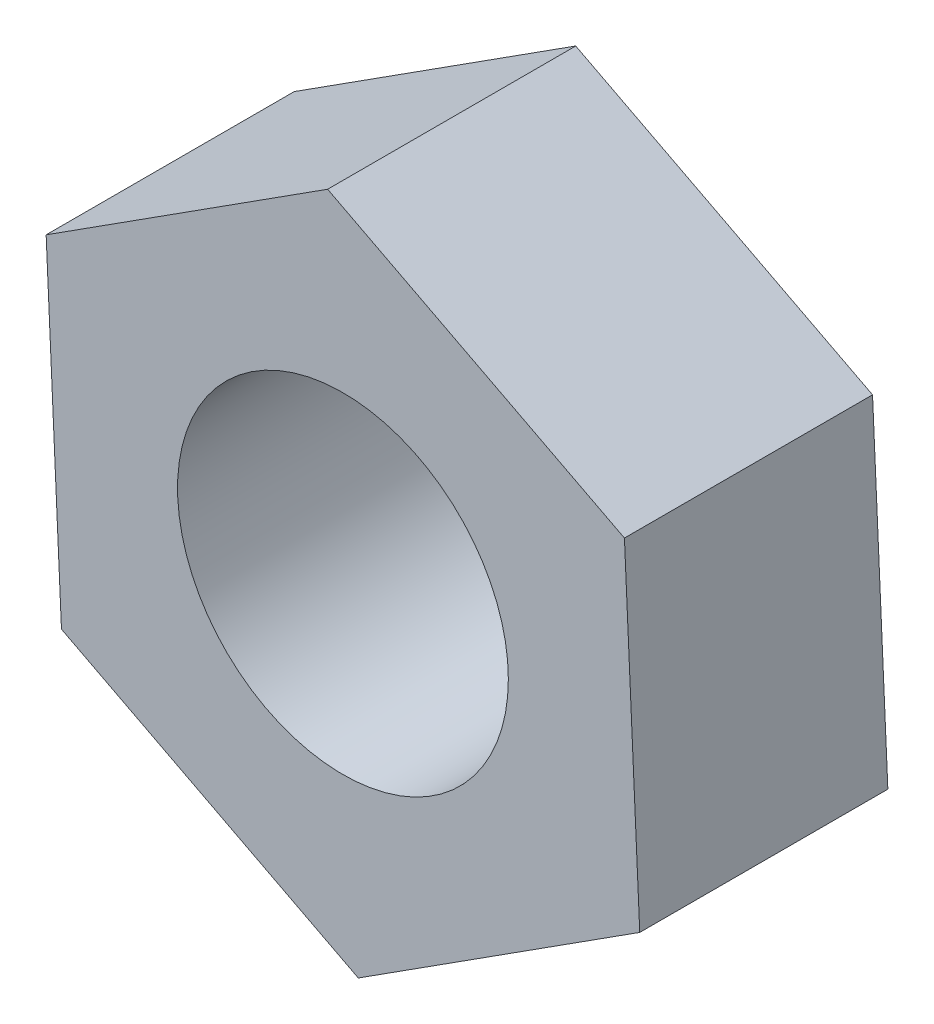
ISO-10303-21;
HEADER;
FILE_DESCRIPTION(('STEP AP214'),'2;1');
FILE_NAME('part.step','',(''),(''),'','','');
FILE_SCHEMA(('AUTOMOTIVE_DESIGN { 1 0 10303 214 1 1 1 1 }'));
ENDSEC;
DATA;
#1=APPLICATION_CONTEXT('core data for automotive mechanical design processes');
#2=APPLICATION_PROTOCOL_DEFINITION('international standard','automotive_design',2000,#1);
#3=PRODUCT_CONTEXT('',#1,'mechanical');
#4=PRODUCT('Part','Part','',(#3));
#5=PRODUCT_RELATED_PRODUCT_CATEGORY('part','',(#4));
#6=PRODUCT_DEFINITION_FORMATION('','',#4);
#7=PRODUCT_DEFINITION_CONTEXT('part definition',#1,'design');
#8=PRODUCT_DEFINITION('design','',#6,#7);
#9=PRODUCT_DEFINITION_SHAPE('','',#8);
#10=(LENGTH_UNIT() NAMED_UNIT(*) SI_UNIT(.MILLI.,.METRE.));
#11=(NAMED_UNIT(*) PLANE_ANGLE_UNIT() SI_UNIT($,.RADIAN.));
#12=(NAMED_UNIT(*) SI_UNIT($,.STERADIAN.) SOLID_ANGLE_UNIT());
#13=UNCERTAINTY_MEASURE_WITH_UNIT(LENGTH_MEASURE(1.E-05),#10,'distance_accuracy_value','');
#14=(GEOMETRIC_REPRESENTATION_CONTEXT(3) GLOBAL_UNCERTAINTY_ASSIGNED_CONTEXT((#13)) GLOBAL_UNIT_ASSIGNED_CONTEXT((#10,
#11,#12)) REPRESENTATION_CONTEXT('',''));
#15=CARTESIAN_POINT('',(0.,0.,0.));
#16=DIRECTION('',(0.,0.,1.));
#17=DIRECTION('',(1.,0.,0.));
#18=AXIS2_PLACEMENT_3D('',#15,#16,#17);
#19=CARTESIAN_POINT('',(0.,0.,3.));
#20=DIRECTION('',(0.,0.,1.));
#21=DIRECTION('',(1.,0.,0.));
#22=AXIS2_PLACEMENT_3D('',#19,#20,#21);
#23=PLANE('',#22);
#24=DIRECTION('',(0.842188821084146,0.539182705250174,0.));
#25=VECTOR('',#24,1.);
#26=CARTESIAN_POINT('',(0.185306669410617,-4.03720135385954,3.));
#27=LINE('',#26,#25);
#28=CARTESIAN_POINT('',(0.185306669410617,-4.03720135385954,3.));
#29=VERTEX_POINT('',#28);
#30=CARTESIAN_POINT('',(3.5889722673406,-1.85812039372949,3.));
#31=VERTEX_POINT('',#30);
#32=EDGE_CURVE('E130',#29,#31,#27,.T.);
#33=ORIENTED_EDGE('',*,*,#32,.T.);
#34=DIRECTION('',(-0.0458515094857943,0.998948266467225,0.));
#35=VECTOR('',#34,1.);
#36=CARTESIAN_POINT('',(3.5889722673406,-1.85812039372949,3.));
#37=LINE('',#36,#35);
#38=CARTESIAN_POINT('',(3.40366559792998,2.17908096013005,3.));
#39=VERTEX_POINT('',#38);
#40=EDGE_CURVE('E88',#31,#39,#37,.T.);
#41=ORIENTED_EDGE('',*,*,#40,.T.);
#42=DIRECTION('',(-0.888040330569941,0.459765561217051,0.));
#43=VECTOR('',#42,1.);
#44=CARTESIAN_POINT('',(3.40366559792998,2.17908096013005,3.));
#45=LINE('',#44,#43);
#46=CARTESIAN_POINT('',(-0.185306669410619,4.03720135385954,3.));
#47=VERTEX_POINT('',#46);
#48=EDGE_CURVE('E101',#39,#47,#45,.T.);
#49=ORIENTED_EDGE('',*,*,#48,.T.);
#50=DIRECTION('',(-0.842188821084146,-0.539182705250174,0.));
#51=VECTOR('',#50,1.);
#52=CARTESIAN_POINT('',(-0.185306669410619,4.03720135385954,3.));
#53=LINE('',#52,#51);
#54=CARTESIAN_POINT('',(-3.5889722673406,1.85812039372949,3.));
#55=VERTEX_POINT('',#54);
#56=EDGE_CURVE('E95',#47,#55,#53,.T.);
#57=ORIENTED_EDGE('',*,*,#56,.T.);
#58=DIRECTION('',(0.0458515094857946,-0.998948266467225,0.));
#59=VECTOR('',#58,1.);
#60=CARTESIAN_POINT('',(-3.5889722673406,1.85812039372949,3.));
#61=LINE('',#60,#59);
#62=CARTESIAN_POINT('',(-3.40366559792998,-2.17908096013005,3.));
#63=VERTEX_POINT('',#62);
#64=EDGE_CURVE('E99',#55,#63,#61,.T.);
#65=ORIENTED_EDGE('',*,*,#64,.T.);
#66=DIRECTION('',(0.888040330569941,-0.459765561217051,0.));
#67=VECTOR('',#66,1.);
#68=CARTESIAN_POINT('',(-3.40366559792998,-2.17908096013005,3.));
#69=LINE('',#68,#67);
#70=EDGE_CURVE('E51',#63,#29,#69,.T.);
#71=ORIENTED_EDGE('',*,*,#70,.T.);
#72=EDGE_LOOP('',(#33,#41,#49,#57,#65,#71));
#73=FACE_BOUND('',#72,.T.);
#74=CARTESIAN_POINT('',(0.,0.,3.));
#75=DIRECTION('',(0.,0.,1.));
#76=DIRECTION('',(1.,0.,0.));
#77=AXIS2_PLACEMENT_3D('',#74,#75,#76);
#78=CIRCLE('',#77,2.);
#79=CARTESIAN_POINT('',(2.,0.,3.));
#80=VERTEX_POINT('',#79);
#81=EDGE_CURVE('E123',#80,#80,#78,.T.);
#82=ORIENTED_EDGE('',*,*,#81,.F.);
#83=EDGE_LOOP('',(#82));
#84=FACE_BOUND('',#83,.T.);
#85=ADVANCED_FACE('F34',(#73,#84),#23,.T.);
#86=CARTESIAN_POINT('',(0.,0.,0.));
#87=DIRECTION('',(0.,0.,1.));
#88=DIRECTION('',(1.,0.,0.));
#89=AXIS2_PLACEMENT_3D('',#86,#87,#88);
#90=PLANE('',#89);
#91=DIRECTION('',(0.842188821084146,0.539182705250174,0.));
#92=VECTOR('',#91,1.);
#93=CARTESIAN_POINT('',(0.185306669410617,-4.03720135385954,0.));
#94=LINE('',#93,#92);
#95=CARTESIAN_POINT('',(0.185306669410617,-4.03720135385954,0.));
#96=VERTEX_POINT('',#95);
#97=CARTESIAN_POINT('',(3.5889722673406,-1.85812039372949,0.));
#98=VERTEX_POINT('',#97);
#99=EDGE_CURVE('E119',#96,#98,#94,.T.);
#100=ORIENTED_EDGE('',*,*,#99,.F.);
#101=DIRECTION('',(0.888040330569941,-0.459765561217051,0.));
#102=VECTOR('',#101,1.);
#103=CARTESIAN_POINT('',(-3.40366559792998,-2.17908096013005,0.));
#104=LINE('',#103,#102);
#105=CARTESIAN_POINT('',(-3.40366559792998,-2.17908096013005,0.));
#106=VERTEX_POINT('',#105);
#107=EDGE_CURVE('E80',#106,#96,#104,.T.);
#108=ORIENTED_EDGE('',*,*,#107,.F.);
#109=DIRECTION('',(0.0458515094857946,-0.998948266467225,0.));
#110=VECTOR('',#109,1.);
#111=CARTESIAN_POINT('',(-3.5889722673406,1.85812039372949,0.));
#112=LINE('',#111,#110);
#113=CARTESIAN_POINT('',(-3.5889722673406,1.85812039372949,0.));
#114=VERTEX_POINT('',#113);
#115=EDGE_CURVE('E74',#114,#106,#112,.T.);
#116=ORIENTED_EDGE('',*,*,#115,.F.);
#117=DIRECTION('',(-0.842188821084146,-0.539182705250174,0.));
#118=VECTOR('',#117,1.);
#119=CARTESIAN_POINT('',(-0.185306669410619,4.03720135385954,0.));
#120=LINE('',#119,#118);
#121=CARTESIAN_POINT('',(-0.185306669410619,4.03720135385954,0.));
#122=VERTEX_POINT('',#121);
#123=EDGE_CURVE('E109',#122,#114,#120,.T.);
#124=ORIENTED_EDGE('',*,*,#123,.F.);
#125=DIRECTION('',(-0.888040330569941,0.459765561217051,0.));
#126=VECTOR('',#125,1.);
#127=CARTESIAN_POINT('',(3.40366559792998,2.17908096013005,0.));
#128=LINE('',#127,#126);
#129=CARTESIAN_POINT('',(3.40366559792998,2.17908096013005,0.));
#130=VERTEX_POINT('',#129);
#131=EDGE_CURVE('E125',#130,#122,#128,.T.);
#132=ORIENTED_EDGE('',*,*,#131,.F.);
#133=DIRECTION('',(-0.0458515094857943,0.998948266467225,0.));
#134=VECTOR('',#133,1.);
#135=CARTESIAN_POINT('',(3.5889722673406,-1.85812039372949,0.));
#136=LINE('',#135,#134);
#137=EDGE_CURVE('E122',#98,#130,#136,.T.);
#138=ORIENTED_EDGE('',*,*,#137,.F.);
#139=EDGE_LOOP('',(#100,#108,#116,#124,#132,#138));
#140=FACE_BOUND('',#139,.T.);
#141=CARTESIAN_POINT('',(0.,0.,0.));
#142=DIRECTION('',(0.,0.,1.));
#143=DIRECTION('',(1.,0.,0.));
#144=AXIS2_PLACEMENT_3D('',#141,#142,#143);
#145=CIRCLE('',#144,2.);
#146=CARTESIAN_POINT('',(2.,0.,0.));
#147=VERTEX_POINT('',#146);
#148=EDGE_CURVE('E223',#147,#147,#145,.T.);
#149=ORIENTED_EDGE('',*,*,#148,.T.);
#150=EDGE_LOOP('',(#149));
#151=FACE_BOUND('',#150,.T.);
#152=ADVANCED_FACE('F139',(#140,#151),#90,.F.);
#153=CARTESIAN_POINT('',(0.185306669410617,-4.03720135385954,3.));
#154=DIRECTION('',(-0.539182705250174,0.842188821084146,0.));
#155=DIRECTION('',(-0.842188821084146,-0.539182705250174,0.));
#156=AXIS2_PLACEMENT_3D('',#153,#154,#155);
#157=PLANE('',#156);
#158=ORIENTED_EDGE('',*,*,#99,.T.);
#159=DIRECTION('',(0.,0.,-1.));
#160=VECTOR('',#159,1.);
#161=CARTESIAN_POINT('',(3.5889722673406,-1.85812039372949,3.));
#162=LINE('',#161,#160);
#163=EDGE_CURVE('E11',#31,#98,#162,.T.);
#164=ORIENTED_EDGE('',*,*,#163,.F.);
#165=ORIENTED_EDGE('',*,*,#32,.F.);
#166=DIRECTION('',(0.,0.,-1.));
#167=VECTOR('',#166,1.);
#168=CARTESIAN_POINT('',(0.185306669410617,-4.03720135385954,3.));
#169=LINE('',#168,#167);
#170=EDGE_CURVE('E115',#29,#96,#169,.T.);
#171=ORIENTED_EDGE('',*,*,#170,.T.);
#172=EDGE_LOOP('',(#158,#164,#165,#171));
#173=FACE_BOUND('',#172,.T.);
#174=ADVANCED_FACE('F36',(#173),#157,.F.);
#175=CARTESIAN_POINT('',(3.5889722673406,-1.85812039372949,3.));
#176=DIRECTION('',(-0.998948266467225,-0.0458515094857943,0.));
#177=DIRECTION('',(0.0458515094857943,-0.998948266467225,0.));
#178=AXIS2_PLACEMENT_3D('',#175,#176,#177);
#179=PLANE('',#178);
#180=ORIENTED_EDGE('',*,*,#137,.T.);
#181=DIRECTION('',(0.,0.,-1.));
#182=VECTOR('',#181,1.);
#183=CARTESIAN_POINT('',(3.40366559792998,2.17908096013005,3.));
#184=LINE('',#183,#182);
#185=EDGE_CURVE('E43',#39,#130,#184,.T.);
#186=ORIENTED_EDGE('',*,*,#185,.F.);
#187=ORIENTED_EDGE('',*,*,#40,.F.);
#188=ORIENTED_EDGE('',*,*,#163,.T.);
#189=EDGE_LOOP('',(#180,#186,#187,#188));
#190=FACE_BOUND('',#189,.T.);
#191=ADVANCED_FACE('F164',(#190),#179,.F.);
#192=CARTESIAN_POINT('',(3.40366559792998,2.17908096013005,3.));
#193=DIRECTION('',(-0.459765561217051,-0.888040330569941,0.));
#194=DIRECTION('',(0.888040330569941,-0.459765561217051,0.));
#195=AXIS2_PLACEMENT_3D('',#192,#193,#194);
#196=PLANE('',#195);
#197=ORIENTED_EDGE('',*,*,#131,.T.);
#198=DIRECTION('',(0.,0.,-1.));
#199=VECTOR('',#198,1.);
#200=CARTESIAN_POINT('',(-0.185306669410619,4.03720135385954,3.));
#201=LINE('',#200,#199);
#202=EDGE_CURVE('E110',#47,#122,#201,.T.);
#203=ORIENTED_EDGE('',*,*,#202,.F.);
#204=ORIENTED_EDGE('',*,*,#48,.F.);
#205=ORIENTED_EDGE('',*,*,#185,.T.);
#206=EDGE_LOOP('',(#197,#203,#204,#205));
#207=FACE_BOUND('',#206,.T.);
#208=ADVANCED_FACE('F136',(#207),#196,.F.);
#209=CARTESIAN_POINT('',(-0.185306669410619,4.03720135385954,3.));
#210=DIRECTION('',(0.539182705250174,-0.842188821084146,0.));
#211=DIRECTION('',(0.842188821084146,0.539182705250174,0.));
#212=AXIS2_PLACEMENT_3D('',#209,#210,#211);
#213=PLANE('',#212);
#214=ORIENTED_EDGE('',*,*,#123,.T.);
#215=DIRECTION('',(0.,0.,-1.));
#216=VECTOR('',#215,1.);
#217=CARTESIAN_POINT('',(-3.5889722673406,1.85812039372949,3.));
#218=LINE('',#217,#216);
#219=EDGE_CURVE('E106',#55,#114,#218,.T.);
#220=ORIENTED_EDGE('',*,*,#219,.F.);
#221=ORIENTED_EDGE('',*,*,#56,.F.);
#222=ORIENTED_EDGE('',*,*,#202,.T.);
#223=EDGE_LOOP('',(#214,#220,#221,#222));
#224=FACE_BOUND('',#223,.T.);
#225=ADVANCED_FACE('F107',(#224),#213,.F.);
#226=CARTESIAN_POINT('',(-3.5889722673406,1.85812039372949,3.));
#227=DIRECTION('',(0.998948266467225,0.0458515094857946,0.));
#228=DIRECTION('',(-0.0458515094857946,0.998948266467225,0.));
#229=AXIS2_PLACEMENT_3D('',#226,#227,#228);
#230=PLANE('',#229);
#231=ORIENTED_EDGE('',*,*,#115,.T.);
#232=DIRECTION('',(0.,0.,-1.));
#233=VECTOR('',#232,1.);
#234=CARTESIAN_POINT('',(-3.40366559792998,-2.17908096013005,3.));
#235=LINE('',#234,#233);
#236=EDGE_CURVE('E111',#63,#106,#235,.T.);
#237=ORIENTED_EDGE('',*,*,#236,.F.);
#238=ORIENTED_EDGE('',*,*,#64,.F.);
#239=ORIENTED_EDGE('',*,*,#219,.T.);
#240=EDGE_LOOP('',(#231,#237,#238,#239));
#241=FACE_BOUND('',#240,.T.);
#242=ADVANCED_FACE('F113',(#241),#230,.F.);
#243=CARTESIAN_POINT('',(-3.40366559792998,-2.17908096013005,3.));
#244=DIRECTION('',(0.459765561217051,0.888040330569941,0.));
#245=DIRECTION('',(-0.888040330569941,0.459765561217051,0.));
#246=AXIS2_PLACEMENT_3D('',#243,#244,#245);
#247=PLANE('',#246);
#248=ORIENTED_EDGE('',*,*,#107,.T.);
#249=ORIENTED_EDGE('',*,*,#170,.F.);
#250=ORIENTED_EDGE('',*,*,#70,.F.);
#251=ORIENTED_EDGE('',*,*,#236,.T.);
#252=EDGE_LOOP('',(#248,#249,#250,#251));
#253=FACE_BOUND('',#252,.T.);
#254=ADVANCED_FACE('F144',(#253),#247,.F.);
#255=CARTESIAN_POINT('',(0.,0.,3.));
#256=DIRECTION('',(0.,0.,-1.));
#257=DIRECTION('',(-1.,0.,0.));
#258=AXIS2_PLACEMENT_3D('',#255,#256,#257);
#259=CYLINDRICAL_SURFACE('',#258,2.);
#260=ORIENTED_EDGE('',*,*,#81,.T.);
#261=EDGE_LOOP('',(#260));
#262=FACE_BOUND('',#261,.T.);
#263=ORIENTED_EDGE('',*,*,#148,.F.);
#264=EDGE_LOOP('',(#263));
#265=FACE_BOUND('',#264,.T.);
#266=ADVANCED_FACE('F146',(#262,#265),#259,.F.);
#267=CLOSED_SHELL('',(#85,#152,#174,#191,#208,#225,#242,#254,#266));
#268=MANIFOLD_SOLID_BREP('B2',#267);
#269=ADVANCED_BREP_SHAPE_REPRESENTATION('',(#18,#268),#14);
#270=SHAPE_DEFINITION_REPRESENTATION(#9,#269);
ENDSEC;
END-ISO-10303-21;
